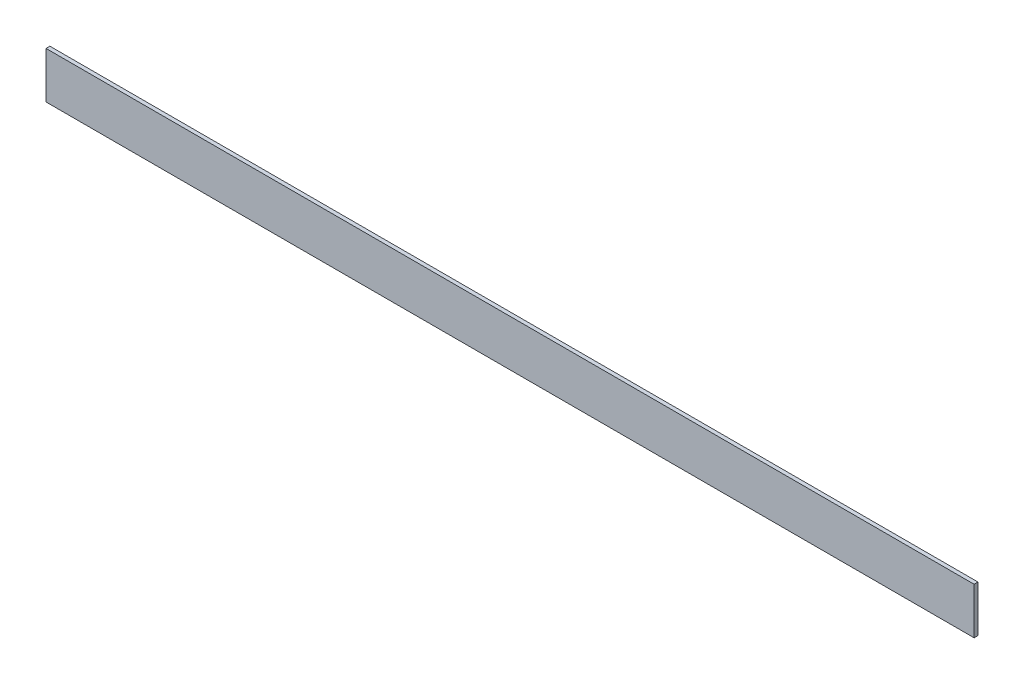
ISO-10303-21;
HEADER;
FILE_DESCRIPTION(('STEP AP214'),'2;1');
FILE_NAME('part.step','',(''),(''),'','','');
FILE_SCHEMA(('AUTOMOTIVE_DESIGN { 1 0 10303 214 1 1 1 1 }'));
ENDSEC;
DATA;
#1=APPLICATION_CONTEXT('core data for automotive mechanical design processes');
#2=APPLICATION_PROTOCOL_DEFINITION('international standard','automotive_design',2000,#1);
#3=PRODUCT_CONTEXT('',#1,'mechanical');
#4=PRODUCT('Part','Part','',(#3));
#5=PRODUCT_RELATED_PRODUCT_CATEGORY('part','',(#4));
#6=PRODUCT_DEFINITION_FORMATION('','',#4);
#7=PRODUCT_DEFINITION_CONTEXT('part definition',#1,'design');
#8=PRODUCT_DEFINITION('design','',#6,#7);
#9=PRODUCT_DEFINITION_SHAPE('','',#8);
#10=(LENGTH_UNIT() NAMED_UNIT(*) SI_UNIT(.MILLI.,.METRE.));
#11=(NAMED_UNIT(*) PLANE_ANGLE_UNIT() SI_UNIT($,.RADIAN.));
#12=(NAMED_UNIT(*) SI_UNIT($,.STERADIAN.) SOLID_ANGLE_UNIT());
#13=UNCERTAINTY_MEASURE_WITH_UNIT(LENGTH_MEASURE(1.E-05),#10,'distance_accuracy_value','');
#14=(GEOMETRIC_REPRESENTATION_CONTEXT(3) GLOBAL_UNCERTAINTY_ASSIGNED_CONTEXT((#13)) GLOBAL_UNIT_ASSIGNED_CONTEXT((#10,
#11,#12)) REPRESENTATION_CONTEXT('',''));
#15=CARTESIAN_POINT('',(0.,0.,0.));
#16=DIRECTION('',(0.,0.,1.));
#17=DIRECTION('',(1.,0.,0.));
#18=AXIS2_PLACEMENT_3D('',#15,#16,#17);
#19=CARTESIAN_POINT('',(1524.,-38.1,-3.175));
#20=DIRECTION('',(0.,0.,1.));
#21=DIRECTION('',(1.,0.,0.));
#22=AXIS2_PLACEMENT_3D('',#19,#20,#21);
#23=PLANE('',#22);
#24=DIRECTION('',(0.,1.,0.));
#25=VECTOR('',#24,1.);
#26=CARTESIAN_POINT('',(0.,-38.1,-3.175));
#27=LINE('',#26,#25);
#28=CARTESIAN_POINT('',(0.,-38.1,-3.175));
#29=VERTEX_POINT('',#28);
#30=CARTESIAN_POINT('',(0.,38.1,-3.175));
#31=VERTEX_POINT('',#30);
#32=EDGE_CURVE('E98',#29,#31,#27,.T.);
#33=ORIENTED_EDGE('',*,*,#32,.T.);
#34=DIRECTION('',(-1.,0.,0.));
#35=VECTOR('',#34,1.);
#36=CARTESIAN_POINT('',(1524.,38.1,-3.175));
#37=LINE('',#36,#35);
#38=CARTESIAN_POINT('',(1524.,38.1,-3.175));
#39=VERTEX_POINT('',#38);
#40=EDGE_CURVE('E11',#39,#31,#37,.T.);
#41=ORIENTED_EDGE('',*,*,#40,.F.);
#42=DIRECTION('',(0.,1.,0.));
#43=VECTOR('',#42,1.);
#44=CARTESIAN_POINT('',(1524.,-38.1,-3.175));
#45=LINE('',#44,#43);
#46=CARTESIAN_POINT('',(1524.,-38.1,-3.175));
#47=VERTEX_POINT('',#46);
#48=EDGE_CURVE('E86',#47,#39,#45,.T.);
#49=ORIENTED_EDGE('',*,*,#48,.F.);
#50=DIRECTION('',(-1.,0.,0.));
#51=VECTOR('',#50,1.);
#52=CARTESIAN_POINT('',(1524.,-38.1,-3.175));
#53=LINE('',#52,#51);
#54=EDGE_CURVE('E94',#47,#29,#53,.T.);
#55=ORIENTED_EDGE('',*,*,#54,.T.);
#56=EDGE_LOOP('',(#33,#41,#49,#55));
#57=FACE_BOUND('',#56,.T.);
#58=ADVANCED_FACE('F35',(#57),#23,.F.);
#59=CARTESIAN_POINT('',(1524.,38.1,3.175));
#60=DIRECTION('',(0.,-1.,0.));
#61=DIRECTION('',(0.,0.,-1.));
#62=AXIS2_PLACEMENT_3D('',#59,#60,#61);
#63=PLANE('',#62);
#64=DIRECTION('',(0.,0.,1.));
#65=VECTOR('',#64,1.);
#66=CARTESIAN_POINT('',(0.,38.1,3.175));
#67=LINE('',#66,#65);
#68=CARTESIAN_POINT('',(0.,38.1,3.175));
#69=VERTEX_POINT('',#68);
#70=EDGE_CURVE('E90',#31,#69,#67,.T.);
#71=ORIENTED_EDGE('',*,*,#70,.T.);
#72=DIRECTION('',(-1.,0.,0.));
#73=VECTOR('',#72,1.);
#74=CARTESIAN_POINT('',(1524.,38.1,3.175));
#75=LINE('',#74,#73);
#76=CARTESIAN_POINT('',(1524.,38.1,3.175));
#77=VERTEX_POINT('',#76);
#78=EDGE_CURVE('E43',#77,#69,#75,.T.);
#79=ORIENTED_EDGE('',*,*,#78,.F.);
#80=DIRECTION('',(0.,0.,1.));
#81=VECTOR('',#80,1.);
#82=CARTESIAN_POINT('',(1524.,38.1,3.175));
#83=LINE('',#82,#81);
#84=EDGE_CURVE('E81',#39,#77,#83,.T.);
#85=ORIENTED_EDGE('',*,*,#84,.F.);
#86=ORIENTED_EDGE('',*,*,#40,.T.);
#87=EDGE_LOOP('',(#71,#79,#85,#86));
#88=FACE_BOUND('',#87,.T.);
#89=ADVANCED_FACE('F89',(#88),#63,.F.);
#90=CARTESIAN_POINT('',(1524.,-38.1,3.175));
#91=DIRECTION('',(0.,0.,-1.));
#92=DIRECTION('',(-1.,0.,0.));
#93=AXIS2_PLACEMENT_3D('',#90,#91,#92);
#94=PLANE('',#93);
#95=DIRECTION('',(0.,-1.,0.));
#96=VECTOR('',#95,1.);
#97=CARTESIAN_POINT('',(0.,-38.1,3.175));
#98=LINE('',#97,#96);
#99=CARTESIAN_POINT('',(0.,-38.1,3.175));
#100=VERTEX_POINT('',#99);
#101=EDGE_CURVE('E68',#69,#100,#98,.T.);
#102=ORIENTED_EDGE('',*,*,#101,.T.);
#103=DIRECTION('',(-1.,0.,0.));
#104=VECTOR('',#103,1.);
#105=CARTESIAN_POINT('',(1524.,-38.1,3.175));
#106=LINE('',#105,#104);
#107=CARTESIAN_POINT('',(1524.,-38.1,3.175));
#108=VERTEX_POINT('',#107);
#109=EDGE_CURVE('E91',#108,#100,#106,.T.);
#110=ORIENTED_EDGE('',*,*,#109,.F.);
#111=DIRECTION('',(0.,-1.,0.));
#112=VECTOR('',#111,1.);
#113=CARTESIAN_POINT('',(1524.,-38.1,3.175));
#114=LINE('',#113,#112);
#115=EDGE_CURVE('E84',#77,#108,#114,.T.);
#116=ORIENTED_EDGE('',*,*,#115,.F.);
#117=ORIENTED_EDGE('',*,*,#78,.T.);
#118=EDGE_LOOP('',(#102,#110,#116,#117));
#119=FACE_BOUND('',#118,.T.);
#120=ADVANCED_FACE('F92',(#119),#94,.F.);
#121=CARTESIAN_POINT('',(1524.,-38.1,3.175));
#122=DIRECTION('',(0.,1.,0.));
#123=DIRECTION('',(0.,0.,1.));
#124=AXIS2_PLACEMENT_3D('',#121,#122,#123);
#125=PLANE('',#124);
#126=DIRECTION('',(0.,0.,-1.));
#127=VECTOR('',#126,1.);
#128=CARTESIAN_POINT('',(0.,-38.1,3.175));
#129=LINE('',#128,#127);
#130=EDGE_CURVE('E74',#100,#29,#129,.T.);
#131=ORIENTED_EDGE('',*,*,#130,.T.);
#132=ORIENTED_EDGE('',*,*,#54,.F.);
#133=DIRECTION('',(0.,0.,-1.));
#134=VECTOR('',#133,1.);
#135=CARTESIAN_POINT('',(1524.,-38.1,3.175));
#136=LINE('',#135,#134);
#137=EDGE_CURVE('E51',#108,#47,#136,.T.);
#138=ORIENTED_EDGE('',*,*,#137,.F.);
#139=ORIENTED_EDGE('',*,*,#109,.T.);
#140=EDGE_LOOP('',(#131,#132,#138,#139));
#141=FACE_BOUND('',#140,.T.);
#142=ADVANCED_FACE('F105',(#141),#125,.F.);
#143=CARTESIAN_POINT('',(1524.,0.,0.));
#144=DIRECTION('',(-1.,0.,0.));
#145=DIRECTION('',(0.,0.,1.));
#146=AXIS2_PLACEMENT_3D('',#143,#144,#145);
#147=PLANE('',#146);
#148=ORIENTED_EDGE('',*,*,#48,.T.);
#149=ORIENTED_EDGE('',*,*,#84,.T.);
#150=ORIENTED_EDGE('',*,*,#115,.T.);
#151=ORIENTED_EDGE('',*,*,#137,.T.);
#152=EDGE_LOOP('',(#148,#149,#150,#151));
#153=FACE_BOUND('',#152,.T.);
#154=ADVANCED_FACE('F82',(#153),#147,.F.);
#155=CARTESIAN_POINT('',(0.,0.,0.));
#156=DIRECTION('',(-1.,0.,0.));
#157=DIRECTION('',(0.,0.,1.));
#158=AXIS2_PLACEMENT_3D('',#155,#156,#157);
#159=PLANE('',#158);
#160=ORIENTED_EDGE('',*,*,#32,.F.);
#161=ORIENTED_EDGE('',*,*,#130,.F.);
#162=ORIENTED_EDGE('',*,*,#101,.F.);
#163=ORIENTED_EDGE('',*,*,#70,.F.);
#164=EDGE_LOOP('',(#160,#161,#162,#163));
#165=FACE_BOUND('',#164,.T.);
#166=ADVANCED_FACE('F108',(#165),#159,.T.);
#167=CLOSED_SHELL('',(#58,#89,#120,#142,#154,#166));
#168=MANIFOLD_SOLID_BREP('B2',#167);
#169=ADVANCED_BREP_SHAPE_REPRESENTATION('',(#18,#168),#14);
#170=SHAPE_DEFINITION_REPRESENTATION(#9,#169);
ENDSEC;
END-ISO-10303-21;
